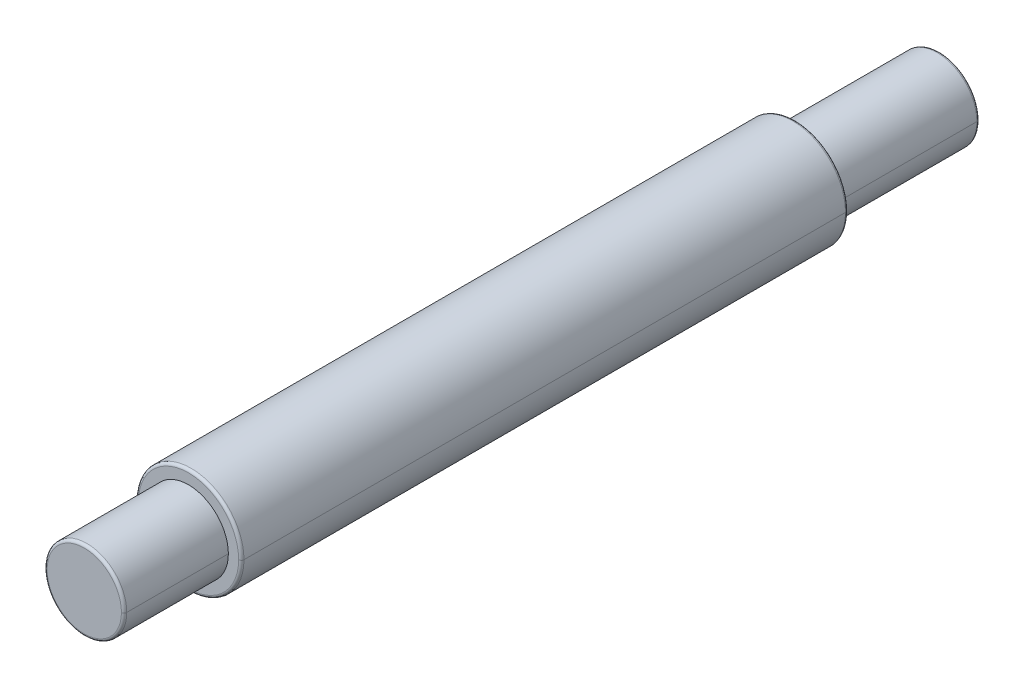
ISO-10303-21;
HEADER;
FILE_DESCRIPTION(('STEP AP214'),'2;1');
FILE_NAME('part.step','',(''),(''),'','','');
FILE_SCHEMA(('AUTOMOTIVE_DESIGN { 1 0 10303 214 1 1 1 1 }'));
ENDSEC;
DATA;
#1=APPLICATION_CONTEXT('core data for automotive mechanical design processes');
#2=APPLICATION_PROTOCOL_DEFINITION('international standard','automotive_design',2000,#1);
#3=PRODUCT_CONTEXT('',#1,'mechanical');
#4=PRODUCT('Part','Part','',(#3));
#5=PRODUCT_RELATED_PRODUCT_CATEGORY('part','',(#4));
#6=PRODUCT_DEFINITION_FORMATION('','',#4);
#7=PRODUCT_DEFINITION_CONTEXT('part definition',#1,'design');
#8=PRODUCT_DEFINITION('design','',#6,#7);
#9=PRODUCT_DEFINITION_SHAPE('','',#8);
#10=(LENGTH_UNIT() NAMED_UNIT(*) SI_UNIT(.MILLI.,.METRE.));
#11=(NAMED_UNIT(*) PLANE_ANGLE_UNIT() SI_UNIT($,.RADIAN.));
#12=(NAMED_UNIT(*) SI_UNIT($,.STERADIAN.) SOLID_ANGLE_UNIT());
#13=UNCERTAINTY_MEASURE_WITH_UNIT(LENGTH_MEASURE(1.E-05),#10,'distance_accuracy_value','');
#14=(GEOMETRIC_REPRESENTATION_CONTEXT(3) GLOBAL_UNCERTAINTY_ASSIGNED_CONTEXT((#13)) GLOBAL_UNIT_ASSIGNED_CONTEXT((#10,
#11,#12)) REPRESENTATION_CONTEXT('',''));
#15=CARTESIAN_POINT('',(0.,0.,0.));
#16=DIRECTION('',(0.,0.,1.));
#17=DIRECTION('',(1.,0.,0.));
#18=AXIS2_PLACEMENT_3D('',#15,#16,#17);
#19=CARTESIAN_POINT('',(0.,0.,32.));
#20=DIRECTION('',(0.,0.,1.));
#21=DIRECTION('',(0.,-1.,0.));
#22=AXIS2_PLACEMENT_3D('',#19,#20,#21);
#23=PLANE('',#22);
#24=CARTESIAN_POINT('',(0.,0.,32.));
#25=DIRECTION('',(0.,0.,1.));
#26=DIRECTION('',(1.,0.,0.));
#27=AXIS2_PLACEMENT_3D('',#24,#25,#26);
#28=CIRCLE('',#27,1.39);
#29=CARTESIAN_POINT('',(1.39,0.,32.));
#30=VERTEX_POINT('',#29);
#31=CARTESIAN_POINT('',(-1.39,0.,32.));
#32=VERTEX_POINT('',#31);
#33=EDGE_CURVE('E220',#30,#32,#28,.T.);
#34=ORIENTED_EDGE('',*,*,#33,.T.);
#35=CARTESIAN_POINT('',(0.,0.,32.));
#36=DIRECTION('',(0.,0.,1.));
#37=DIRECTION('',(1.,0.,0.));
#38=AXIS2_PLACEMENT_3D('',#35,#36,#37);
#39=CIRCLE('',#38,1.39);
#40=EDGE_CURVE('E180',#32,#30,#39,.T.);
#41=ORIENTED_EDGE('',*,*,#40,.T.);
#42=EDGE_LOOP('',(#34,#41));
#43=FACE_BOUND('',#42,.T.);
#44=ADVANCED_FACE('F17',(#43),#23,.T.);
#45=CARTESIAN_POINT('',(0.,0.,28.1));
#46=DIRECTION('',(0.,0.,1.));
#47=DIRECTION('',(1.,0.,0.));
#48=AXIS2_PLACEMENT_3D('',#45,#46,#47);
#49=CYLINDRICAL_SURFACE('',#48,1.49);
#50=DIRECTION('',(0.,0.,1.));
#51=VECTOR('',#50,1.);
#52=CARTESIAN_POINT('',(-1.49,0.,28.1));
#53=LINE('',#52,#51);
#54=CARTESIAN_POINT('',(-1.49,0.,28.1));
#55=VERTEX_POINT('',#54);
#56=CARTESIAN_POINT('',(-1.49,0.,31.9));
#57=VERTEX_POINT('',#56);
#58=EDGE_CURVE('E186',#55,#57,#53,.T.);
#59=ORIENTED_EDGE('',*,*,#58,.F.);
#60=CARTESIAN_POINT('',(0.,0.,28.1));
#61=DIRECTION('',(0.,0.,1.));
#62=DIRECTION('',(1.,0.,0.));
#63=AXIS2_PLACEMENT_3D('',#60,#61,#62);
#64=CIRCLE('',#63,1.49);
#65=CARTESIAN_POINT('',(1.49,0.,28.1));
#66=VERTEX_POINT('',#65);
#67=EDGE_CURVE('E11',#55,#66,#64,.T.);
#68=ORIENTED_EDGE('',*,*,#67,.T.);
#69=DIRECTION('',(0.,0.,1.));
#70=VECTOR('',#69,1.);
#71=CARTESIAN_POINT('',(1.49,0.,28.1));
#72=LINE('',#71,#70);
#73=CARTESIAN_POINT('',(1.49,0.,31.9));
#74=VERTEX_POINT('',#73);
#75=EDGE_CURVE('E208',#66,#74,#72,.T.);
#76=ORIENTED_EDGE('',*,*,#75,.T.);
#77=CARTESIAN_POINT('',(0.,0.,31.9));
#78=DIRECTION('',(0.,0.,1.));
#79=DIRECTION('',(1.,0.,0.));
#80=AXIS2_PLACEMENT_3D('',#77,#78,#79);
#81=CIRCLE('',#80,1.49);
#82=EDGE_CURVE('E66',#57,#74,#81,.T.);
#83=ORIENTED_EDGE('',*,*,#82,.F.);
#84=EDGE_LOOP('',(#59,#68,#76,#83));
#85=FACE_BOUND('',#84,.T.);
#86=ADVANCED_FACE('F408',(#85),#49,.T.);
#87=CARTESIAN_POINT('',(0.,0.,28.1));
#88=DIRECTION('',(0.,0.,1.));
#89=DIRECTION('',(0.,-1.,0.));
#90=AXIS2_PLACEMENT_3D('',#87,#88,#89);
#91=PLANE('',#90);
#92=CARTESIAN_POINT('',(0.,0.,28.1));
#93=DIRECTION('',(0.,0.,1.));
#94=DIRECTION('',(1.,0.,0.));
#95=AXIS2_PLACEMENT_3D('',#92,#93,#94);
#96=CIRCLE('',#95,1.49);
#97=EDGE_CURVE('E182',#66,#55,#96,.T.);
#98=ORIENTED_EDGE('',*,*,#97,.F.);
#99=ORIENTED_EDGE('',*,*,#67,.F.);
#100=EDGE_LOOP('',(#98,#99));
#101=FACE_BOUND('',#100,.T.);
#102=CARTESIAN_POINT('',(0.,0.,28.1));
#103=DIRECTION('',(0.,0.,1.));
#104=DIRECTION('',(1.,0.,0.));
#105=AXIS2_PLACEMENT_3D('',#102,#103,#104);
#106=CIRCLE('',#105,1.875);
#107=CARTESIAN_POINT('',(1.875,0.,28.1));
#108=VERTEX_POINT('',#107);
#109=CARTESIAN_POINT('',(-1.875,0.,28.1));
#110=VERTEX_POINT('',#109);
#111=EDGE_CURVE('E142',#108,#110,#106,.T.);
#112=ORIENTED_EDGE('',*,*,#111,.T.);
#113=CARTESIAN_POINT('',(0.,0.,28.1));
#114=DIRECTION('',(0.,0.,1.));
#115=DIRECTION('',(1.,0.,0.));
#116=AXIS2_PLACEMENT_3D('',#113,#114,#115);
#117=CIRCLE('',#116,1.875);
#118=EDGE_CURVE('E134',#110,#108,#117,.T.);
#119=ORIENTED_EDGE('',*,*,#118,.T.);
#120=EDGE_LOOP('',(#112,#119));
#121=FACE_BOUND('',#120,.T.);
#122=ADVANCED_FACE('F140',(#101,#121),#91,.T.);
#123=CARTESIAN_POINT('',(0.,0.,5.4));
#124=DIRECTION('',(0.,0.,1.));
#125=DIRECTION('',(1.,0.,0.));
#126=AXIS2_PLACEMENT_3D('',#123,#124,#125);
#127=CYLINDRICAL_SURFACE('',#126,1.975);
#128=DIRECTION('',(0.,0.,1.));
#129=VECTOR('',#128,1.);
#130=CARTESIAN_POINT('',(-1.975,0.,5.4));
#131=LINE('',#130,#129);
#132=CARTESIAN_POINT('',(-1.975,0.,5.5));
#133=VERTEX_POINT('',#132);
#134=CARTESIAN_POINT('',(-1.975,0.,28.));
#135=VERTEX_POINT('',#134);
#136=EDGE_CURVE('E236',#133,#135,#131,.T.);
#137=ORIENTED_EDGE('',*,*,#136,.F.);
#138=CARTESIAN_POINT('',(0.,0.,5.5));
#139=DIRECTION('',(0.,0.,1.));
#140=DIRECTION('',(1.,0.,0.));
#141=AXIS2_PLACEMENT_3D('',#138,#139,#140);
#142=CIRCLE('',#141,1.975);
#143=CARTESIAN_POINT('',(1.975,0.,5.5));
#144=VERTEX_POINT('',#143);
#145=EDGE_CURVE('E179',#133,#144,#142,.T.);
#146=ORIENTED_EDGE('',*,*,#145,.T.);
#147=DIRECTION('',(0.,0.,1.));
#148=VECTOR('',#147,1.);
#149=CARTESIAN_POINT('',(1.975,0.,5.4));
#150=LINE('',#149,#148);
#151=CARTESIAN_POINT('',(1.975,0.,28.));
#152=VERTEX_POINT('',#151);
#153=EDGE_CURVE('E21',#144,#152,#150,.T.);
#154=ORIENTED_EDGE('',*,*,#153,.T.);
#155=CARTESIAN_POINT('',(0.,0.,28.));
#156=DIRECTION('',(0.,0.,1.));
#157=DIRECTION('',(1.,0.,0.));
#158=AXIS2_PLACEMENT_3D('',#155,#156,#157);
#159=CIRCLE('',#158,1.975);
#160=EDGE_CURVE('E145',#135,#152,#159,.T.);
#161=ORIENTED_EDGE('',*,*,#160,.F.);
#162=EDGE_LOOP('',(#137,#146,#154,#161));
#163=FACE_BOUND('',#162,.T.);
#164=ADVANCED_FACE('F279',(#163),#127,.T.);
#165=CARTESIAN_POINT('',(0.,0.,5.4));
#166=DIRECTION('',(0.,0.,-1.));
#167=DIRECTION('',(-1.,0.,0.));
#168=AXIS2_PLACEMENT_3D('',#165,#166,#167);
#169=PLANE('',#168);
#170=CARTESIAN_POINT('',(0.,0.,5.4));
#171=DIRECTION('',(0.,0.,1.));
#172=DIRECTION('',(1.,0.,0.));
#173=AXIS2_PLACEMENT_3D('',#170,#171,#172);
#174=CIRCLE('',#173,1.49);
#175=CARTESIAN_POINT('',(1.49,0.,5.4));
#176=VERTEX_POINT('',#175);
#177=CARTESIAN_POINT('',(-1.49,0.,5.4));
#178=VERTEX_POINT('',#177);
#179=EDGE_CURVE('E169',#176,#178,#174,.T.);
#180=ORIENTED_EDGE('',*,*,#179,.T.);
#181=CARTESIAN_POINT('',(0.,0.,5.4));
#182=DIRECTION('',(0.,0.,1.));
#183=DIRECTION('',(1.,0.,0.));
#184=AXIS2_PLACEMENT_3D('',#181,#182,#183);
#185=CIRCLE('',#184,1.49);
#186=EDGE_CURVE('E28',#178,#176,#185,.T.);
#187=ORIENTED_EDGE('',*,*,#186,.T.);
#188=EDGE_LOOP('',(#180,#187));
#189=FACE_BOUND('',#188,.T.);
#190=CARTESIAN_POINT('',(0.,0.,5.4));
#191=DIRECTION('',(0.,0.,1.));
#192=DIRECTION('',(1.,0.,0.));
#193=AXIS2_PLACEMENT_3D('',#190,#191,#192);
#194=CIRCLE('',#193,1.875);
#195=CARTESIAN_POINT('',(1.875,0.,5.4));
#196=VERTEX_POINT('',#195);
#197=CARTESIAN_POINT('',(-1.875,0.,5.4));
#198=VERTEX_POINT('',#197);
#199=EDGE_CURVE('E154',#196,#198,#194,.T.);
#200=ORIENTED_EDGE('',*,*,#199,.F.);
#201=CARTESIAN_POINT('',(0.,0.,5.4));
#202=DIRECTION('',(0.,0.,1.));
#203=DIRECTION('',(1.,0.,0.));
#204=AXIS2_PLACEMENT_3D('',#201,#202,#203);
#205=CIRCLE('',#204,1.875);
#206=EDGE_CURVE('E177',#198,#196,#205,.T.);
#207=ORIENTED_EDGE('',*,*,#206,.F.);
#208=EDGE_LOOP('',(#200,#207));
#209=FACE_BOUND('',#208,.T.);
#210=ADVANCED_FACE('F276',(#189,#209),#169,.T.);
#211=CARTESIAN_POINT('',(0.,0.,0.));
#212=DIRECTION('',(0.,0.,1.));
#213=DIRECTION('',(1.,0.,0.));
#214=AXIS2_PLACEMENT_3D('',#211,#212,#213);
#215=CYLINDRICAL_SURFACE('',#214,1.49);
#216=DIRECTION('',(0.,0.,1.));
#217=VECTOR('',#216,1.);
#218=CARTESIAN_POINT('',(-1.49,0.,0.));
#219=LINE('',#218,#217);
#220=CARTESIAN_POINT('',(-1.49,0.,0.1));
#221=VERTEX_POINT('',#220);
#222=EDGE_CURVE('E172',#221,#178,#219,.T.);
#223=ORIENTED_EDGE('',*,*,#222,.F.);
#224=CARTESIAN_POINT('',(0.,0.,0.1));
#225=DIRECTION('',(0.,0.,1.));
#226=DIRECTION('',(1.,0.,0.));
#227=AXIS2_PLACEMENT_3D('',#224,#225,#226);
#228=CIRCLE('',#227,1.49);
#229=CARTESIAN_POINT('',(1.49,0.,0.1));
#230=VERTEX_POINT('',#229);
#231=EDGE_CURVE('E114',#221,#230,#228,.T.);
#232=ORIENTED_EDGE('',*,*,#231,.T.);
#233=DIRECTION('',(0.,0.,1.));
#234=VECTOR('',#233,1.);
#235=CARTESIAN_POINT('',(1.49,0.,0.));
#236=LINE('',#235,#234);
#237=EDGE_CURVE('E164',#230,#176,#236,.T.);
#238=ORIENTED_EDGE('',*,*,#237,.T.);
#239=ORIENTED_EDGE('',*,*,#186,.F.);
#240=EDGE_LOOP('',(#223,#232,#238,#239));
#241=FACE_BOUND('',#240,.T.);
#242=ADVANCED_FACE('F271',(#241),#215,.T.);
#243=CARTESIAN_POINT('',(0.,0.,0.));
#244=DIRECTION('',(0.,0.,-1.));
#245=DIRECTION('',(-1.,0.,0.));
#246=AXIS2_PLACEMENT_3D('',#243,#244,#245);
#247=PLANE('',#246);
#248=CARTESIAN_POINT('',(0.,0.,0.));
#249=DIRECTION('',(0.,0.,1.));
#250=DIRECTION('',(1.,0.,0.));
#251=AXIS2_PLACEMENT_3D('',#248,#249,#250);
#252=CIRCLE('',#251,1.39);
#253=CARTESIAN_POINT('',(1.39,0.,0.));
#254=VERTEX_POINT('',#253);
#255=CARTESIAN_POINT('',(-1.39,0.,0.));
#256=VERTEX_POINT('',#255);
#257=EDGE_CURVE('E229',#254,#256,#252,.T.);
#258=ORIENTED_EDGE('',*,*,#257,.F.);
#259=CARTESIAN_POINT('',(0.,0.,0.));
#260=DIRECTION('',(0.,0.,1.));
#261=DIRECTION('',(1.,0.,0.));
#262=AXIS2_PLACEMENT_3D('',#259,#260,#261);
#263=CIRCLE('',#262,1.39);
#264=EDGE_CURVE('E42',#256,#254,#263,.T.);
#265=ORIENTED_EDGE('',*,*,#264,.F.);
#266=EDGE_LOOP('',(#258,#265));
#267=FACE_BOUND('',#266,.T.);
#268=ADVANCED_FACE('F419',(#267),#247,.T.);
#269=CARTESIAN_POINT('',(0.,0.,28.));
#270=DIRECTION('',(0.,0.,1.));
#271=DIRECTION('',(1.,0.,0.));
#272=AXIS2_PLACEMENT_3D('',#269,#270,#271);
#273=TOROIDAL_SURFACE('',#272,1.875,0.1);
#274=CARTESIAN_POINT('',(-1.875,0.,28.));
#275=DIRECTION('',(0.,1.,0.));
#276=DIRECTION('',(-1.,0.,0.));
#277=AXIS2_PLACEMENT_3D('',#274,#275,#276);
#278=CIRCLE('',#277,0.1);
#279=EDGE_CURVE('E157',#135,#110,#278,.T.);
#280=ORIENTED_EDGE('',*,*,#279,.F.);
#281=ORIENTED_EDGE('',*,*,#160,.T.);
#282=CARTESIAN_POINT('',(1.875,0.,28.));
#283=DIRECTION('',(0.,-1.,0.));
#284=DIRECTION('',(1.,0.,0.));
#285=AXIS2_PLACEMENT_3D('',#282,#283,#284);
#286=CIRCLE('',#285,0.1);
#287=EDGE_CURVE('E148',#152,#108,#286,.T.);
#288=ORIENTED_EDGE('',*,*,#287,.T.);
#289=ORIENTED_EDGE('',*,*,#118,.F.);
#290=EDGE_LOOP('',(#280,#281,#288,#289));
#291=FACE_BOUND('',#290,.T.);
#292=ADVANCED_FACE('F149',(#291),#273,.T.);
#293=CARTESIAN_POINT('',(0.,0.,5.5));
#294=DIRECTION('',(0.,0.,1.));
#295=DIRECTION('',(1.,0.,0.));
#296=AXIS2_PLACEMENT_3D('',#293,#294,#295);
#297=TOROIDAL_SURFACE('',#296,1.875,0.1);
#298=CARTESIAN_POINT('',(-1.875,0.,5.5));
#299=DIRECTION('',(0.,1.,0.));
#300=DIRECTION('',(-1.,0.,0.));
#301=AXIS2_PLACEMENT_3D('',#298,#299,#300);
#302=CIRCLE('',#301,0.1);
#303=EDGE_CURVE('E190',#198,#133,#302,.T.);
#304=ORIENTED_EDGE('',*,*,#303,.F.);
#305=ORIENTED_EDGE('',*,*,#206,.T.);
#306=CARTESIAN_POINT('',(1.875,0.,5.5));
#307=DIRECTION('',(0.,-1.,0.));
#308=DIRECTION('',(0.,0.,-1.));
#309=AXIS2_PLACEMENT_3D('',#306,#307,#308);
#310=CIRCLE('',#309,0.1);
#311=EDGE_CURVE('E194',#196,#144,#310,.T.);
#312=ORIENTED_EDGE('',*,*,#311,.T.);
#313=ORIENTED_EDGE('',*,*,#145,.F.);
#314=EDGE_LOOP('',(#304,#305,#312,#313));
#315=FACE_BOUND('',#314,.T.);
#316=ADVANCED_FACE('F291',(#315),#297,.T.);
#317=CARTESIAN_POINT('',(0.,0.,31.9));
#318=DIRECTION('',(0.,0.,1.));
#319=DIRECTION('',(1.,0.,0.));
#320=AXIS2_PLACEMENT_3D('',#317,#318,#319);
#321=TOROIDAL_SURFACE('',#320,1.39,0.1);
#322=CARTESIAN_POINT('',(-1.39,0.,31.9));
#323=DIRECTION('',(0.,1.,0.));
#324=DIRECTION('',(0.,0.,1.));
#325=AXIS2_PLACEMENT_3D('',#322,#323,#324);
#326=CIRCLE('',#325,0.100000000000003);
#327=EDGE_CURVE('E168',#57,#32,#326,.T.);
#328=ORIENTED_EDGE('',*,*,#327,.F.);
#329=ORIENTED_EDGE('',*,*,#82,.T.);
#330=CARTESIAN_POINT('',(1.39,0.,31.9));
#331=DIRECTION('',(0.,-1.,0.));
#332=DIRECTION('',(1.,0.,0.));
#333=AXIS2_PLACEMENT_3D('',#330,#331,#332);
#334=CIRCLE('',#333,0.1);
#335=EDGE_CURVE('E248',#74,#30,#334,.T.);
#336=ORIENTED_EDGE('',*,*,#335,.T.);
#337=ORIENTED_EDGE('',*,*,#40,.F.);
#338=EDGE_LOOP('',(#328,#329,#336,#337));
#339=FACE_BOUND('',#338,.T.);
#340=ADVANCED_FACE('F403',(#339),#321,.T.);
#341=CARTESIAN_POINT('',(0.,0.,0.1));
#342=DIRECTION('',(0.,0.,1.));
#343=DIRECTION('',(1.,0.,0.));
#344=AXIS2_PLACEMENT_3D('',#341,#342,#343);
#345=TOROIDAL_SURFACE('',#344,1.39,0.1);
#346=CARTESIAN_POINT('',(-1.39,0.,0.1));
#347=DIRECTION('',(0.,1.,0.));
#348=DIRECTION('',(-1.,0.,0.));
#349=AXIS2_PLACEMENT_3D('',#346,#347,#348);
#350=CIRCLE('',#349,0.1);
#351=EDGE_CURVE('E227',#256,#221,#350,.T.);
#352=ORIENTED_EDGE('',*,*,#351,.F.);
#353=ORIENTED_EDGE('',*,*,#264,.T.);
#354=CARTESIAN_POINT('',(1.39,0.,0.1));
#355=DIRECTION('',(0.,-1.,0.));
#356=DIRECTION('',(0.,0.,-1.));
#357=AXIS2_PLACEMENT_3D('',#354,#355,#356);
#358=CIRCLE('',#357,0.1);
#359=EDGE_CURVE('E224',#254,#230,#358,.T.);
#360=ORIENTED_EDGE('',*,*,#359,.T.);
#361=ORIENTED_EDGE('',*,*,#231,.F.);
#362=EDGE_LOOP('',(#352,#353,#360,#361));
#363=FACE_BOUND('',#362,.T.);
#364=ADVANCED_FACE('F399',(#363),#345,.T.);
#365=CARTESIAN_POINT('',(0.,0.,0.1));
#366=DIRECTION('',(0.,0.,1.));
#367=DIRECTION('',(1.,0.,0.));
#368=AXIS2_PLACEMENT_3D('',#365,#366,#367);
#369=TOROIDAL_SURFACE('',#368,1.39,0.1);
#370=ORIENTED_EDGE('',*,*,#257,.T.);
#371=ORIENTED_EDGE('',*,*,#351,.T.);
#372=CARTESIAN_POINT('',(0.,0.,0.1));
#373=DIRECTION('',(0.,0.,1.));
#374=DIRECTION('',(1.,0.,0.));
#375=AXIS2_PLACEMENT_3D('',#372,#373,#374);
#376=CIRCLE('',#375,1.49);
#377=EDGE_CURVE('E175',#230,#221,#376,.T.);
#378=ORIENTED_EDGE('',*,*,#377,.F.);
#379=ORIENTED_EDGE('',*,*,#359,.F.);
#380=EDGE_LOOP('',(#370,#371,#378,#379));
#381=FACE_BOUND('',#380,.T.);
#382=ADVANCED_FACE('F19',(#381),#369,.T.);
#383=CARTESIAN_POINT('',(0.,0.,31.9));
#384=DIRECTION('',(0.,0.,1.));
#385=DIRECTION('',(1.,0.,0.));
#386=AXIS2_PLACEMENT_3D('',#383,#384,#385);
#387=TOROIDAL_SURFACE('',#386,1.39,0.1);
#388=CARTESIAN_POINT('',(0.,0.,31.9));
#389=DIRECTION('',(0.,0.,1.));
#390=DIRECTION('',(1.,0.,0.));
#391=AXIS2_PLACEMENT_3D('',#388,#389,#390);
#392=CIRCLE('',#391,1.49);
#393=EDGE_CURVE('E201',#74,#57,#392,.T.);
#394=ORIENTED_EDGE('',*,*,#393,.T.);
#395=ORIENTED_EDGE('',*,*,#327,.T.);
#396=ORIENTED_EDGE('',*,*,#33,.F.);
#397=ORIENTED_EDGE('',*,*,#335,.F.);
#398=EDGE_LOOP('',(#394,#395,#396,#397));
#399=FACE_BOUND('',#398,.T.);
#400=ADVANCED_FACE('F438',(#399),#387,.T.);
#401=CARTESIAN_POINT('',(0.,0.,5.5));
#402=DIRECTION('',(0.,0.,1.));
#403=DIRECTION('',(1.,0.,0.));
#404=AXIS2_PLACEMENT_3D('',#401,#402,#403);
#405=TOROIDAL_SURFACE('',#404,1.875,0.1);
#406=ORIENTED_EDGE('',*,*,#199,.T.);
#407=ORIENTED_EDGE('',*,*,#303,.T.);
#408=CARTESIAN_POINT('',(0.,0.,5.5));
#409=DIRECTION('',(0.,0.,1.));
#410=DIRECTION('',(1.,0.,0.));
#411=AXIS2_PLACEMENT_3D('',#408,#409,#410);
#412=CIRCLE('',#411,1.975);
#413=EDGE_CURVE('E216',#144,#133,#412,.T.);
#414=ORIENTED_EDGE('',*,*,#413,.F.);
#415=ORIENTED_EDGE('',*,*,#311,.F.);
#416=EDGE_LOOP('',(#406,#407,#414,#415));
#417=FACE_BOUND('',#416,.T.);
#418=ADVANCED_FACE('F285',(#417),#405,.T.);
#419=CARTESIAN_POINT('',(0.,0.,28.));
#420=DIRECTION('',(0.,0.,1.));
#421=DIRECTION('',(1.,0.,0.));
#422=AXIS2_PLACEMENT_3D('',#419,#420,#421);
#423=TOROIDAL_SURFACE('',#422,1.875,0.1);
#424=CARTESIAN_POINT('',(0.,0.,28.));
#425=DIRECTION('',(0.,0.,1.));
#426=DIRECTION('',(1.,0.,0.));
#427=AXIS2_PLACEMENT_3D('',#424,#425,#426);
#428=CIRCLE('',#427,1.975);
#429=EDGE_CURVE('E233',#152,#135,#428,.T.);
#430=ORIENTED_EDGE('',*,*,#429,.T.);
#431=ORIENTED_EDGE('',*,*,#279,.T.);
#432=ORIENTED_EDGE('',*,*,#111,.F.);
#433=ORIENTED_EDGE('',*,*,#287,.F.);
#434=EDGE_LOOP('',(#430,#431,#432,#433));
#435=FACE_BOUND('',#434,.T.);
#436=ADVANCED_FACE('F156',(#435),#423,.T.);
#437=CARTESIAN_POINT('',(0.,0.,0.));
#438=DIRECTION('',(0.,0.,1.));
#439=DIRECTION('',(1.,0.,0.));
#440=AXIS2_PLACEMENT_3D('',#437,#438,#439);
#441=CYLINDRICAL_SURFACE('',#440,1.49);
#442=ORIENTED_EDGE('',*,*,#377,.T.);
#443=ORIENTED_EDGE('',*,*,#222,.T.);
#444=ORIENTED_EDGE('',*,*,#179,.F.);
#445=ORIENTED_EDGE('',*,*,#237,.F.);
#446=EDGE_LOOP('',(#442,#443,#444,#445));
#447=FACE_BOUND('',#446,.T.);
#448=ADVANCED_FACE('F274',(#447),#441,.T.);
#449=CARTESIAN_POINT('',(0.,0.,5.4));
#450=DIRECTION('',(0.,0.,1.));
#451=DIRECTION('',(1.,0.,0.));
#452=AXIS2_PLACEMENT_3D('',#449,#450,#451);
#453=CYLINDRICAL_SURFACE('',#452,1.975);
#454=ORIENTED_EDGE('',*,*,#413,.T.);
#455=ORIENTED_EDGE('',*,*,#136,.T.);
#456=ORIENTED_EDGE('',*,*,#429,.F.);
#457=ORIENTED_EDGE('',*,*,#153,.F.);
#458=EDGE_LOOP('',(#454,#455,#456,#457));
#459=FACE_BOUND('',#458,.T.);
#460=ADVANCED_FACE('F296',(#459),#453,.T.);
#461=CARTESIAN_POINT('',(0.,0.,28.1));
#462=DIRECTION('',(0.,0.,1.));
#463=DIRECTION('',(1.,0.,0.));
#464=AXIS2_PLACEMENT_3D('',#461,#462,#463);
#465=CYLINDRICAL_SURFACE('',#464,1.49);
#466=ORIENTED_EDGE('',*,*,#97,.T.);
#467=ORIENTED_EDGE('',*,*,#58,.T.);
#468=ORIENTED_EDGE('',*,*,#393,.F.);
#469=ORIENTED_EDGE('',*,*,#75,.F.);
#470=EDGE_LOOP('',(#466,#467,#468,#469));
#471=FACE_BOUND('',#470,.T.);
#472=ADVANCED_FACE('F456',(#471),#465,.T.);
#473=CLOSED_SHELL('',(#44,#86,#122,#164,#210,#242,#268,#292,#316,#340,#364,#382,#400,#418,#436,
#448,#460,#472));
#474=MANIFOLD_SOLID_BREP('B1',#473);
#475=ADVANCED_BREP_SHAPE_REPRESENTATION('',(#18,#474),#14);
#476=SHAPE_DEFINITION_REPRESENTATION(#9,#475);
ENDSEC;
END-ISO-10303-21;
